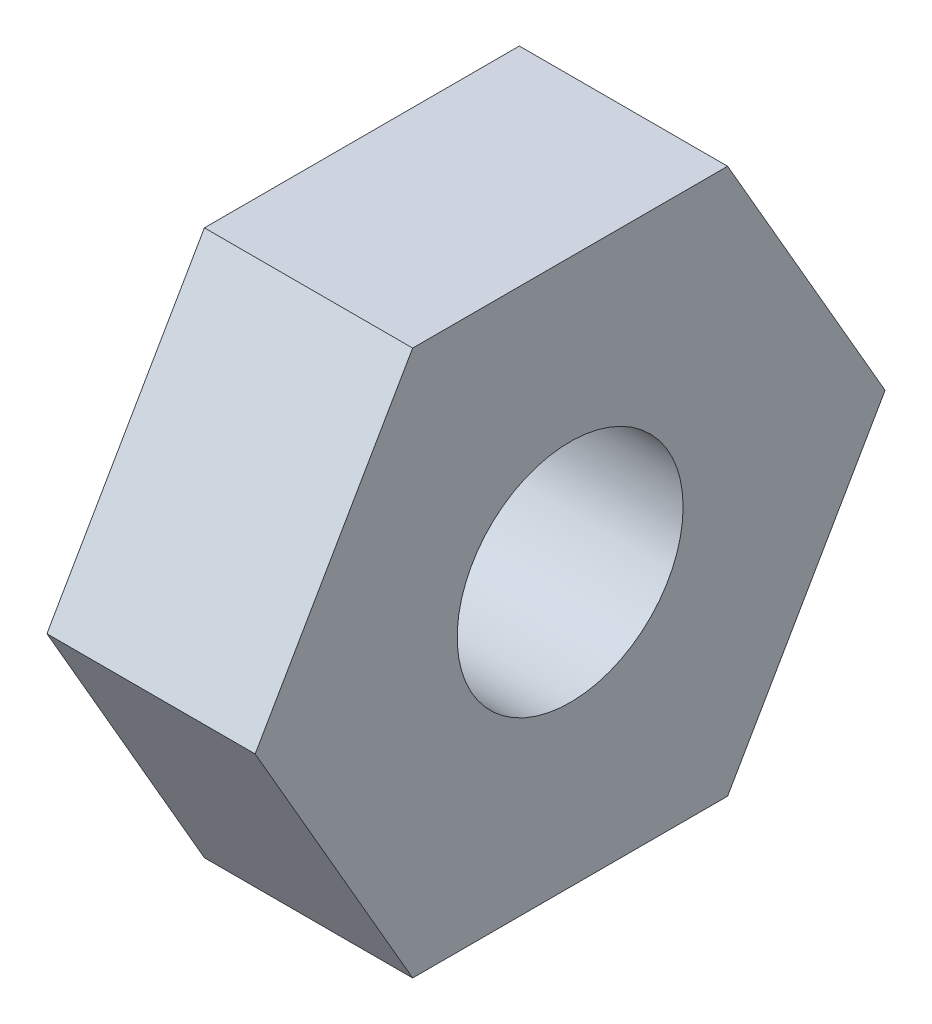
ISO-10303-21;
HEADER;
FILE_DESCRIPTION(('STEP AP214'),'2;1');
FILE_NAME('part.step','',(''),(''),'','','');
FILE_SCHEMA(('AUTOMOTIVE_DESIGN { 1 0 10303 214 1 1 1 1 }'));
ENDSEC;
DATA;
#1=APPLICATION_CONTEXT('core data for automotive mechanical design processes');
#2=APPLICATION_PROTOCOL_DEFINITION('international standard','automotive_design',2000,#1);
#3=PRODUCT_CONTEXT('',#1,'mechanical');
#4=PRODUCT('Part','Part','',(#3));
#5=PRODUCT_RELATED_PRODUCT_CATEGORY('part','',(#4));
#6=PRODUCT_DEFINITION_FORMATION('','',#4);
#7=PRODUCT_DEFINITION_CONTEXT('part definition',#1,'design');
#8=PRODUCT_DEFINITION('design','',#6,#7);
#9=PRODUCT_DEFINITION_SHAPE('','',#8);
#10=(LENGTH_UNIT() NAMED_UNIT(*) SI_UNIT(.MILLI.,.METRE.));
#11=(NAMED_UNIT(*) PLANE_ANGLE_UNIT() SI_UNIT($,.RADIAN.));
#12=(NAMED_UNIT(*) SI_UNIT($,.STERADIAN.) SOLID_ANGLE_UNIT());
#13=UNCERTAINTY_MEASURE_WITH_UNIT(LENGTH_MEASURE(1.E-05),#10,'distance_accuracy_value','');
#14=(GEOMETRIC_REPRESENTATION_CONTEXT(3) GLOBAL_UNCERTAINTY_ASSIGNED_CONTEXT((#13)) GLOBAL_UNIT_ASSIGNED_CONTEXT((#10,
#11,#12)) REPRESENTATION_CONTEXT('',''));
#15=CARTESIAN_POINT('',(0.,0.,0.));
#16=DIRECTION('',(0.,0.,1.));
#17=DIRECTION('',(1.,0.,0.));
#18=AXIS2_PLACEMENT_3D('',#15,#16,#17);
#19=CARTESIAN_POINT('',(4.572,0.,0.));
#20=DIRECTION('',(1.,0.,0.));
#21=DIRECTION('',(0.,0.,-1.));
#22=AXIS2_PLACEMENT_3D('',#19,#20,#21);
#23=PLANE('',#22);
#24=DIRECTION('',(0.,0.,-1.));
#25=VECTOR('',#24,1.);
#26=CARTESIAN_POINT('',(4.572,-5.9875,3.45688473677289));
#27=LINE('',#26,#25);
#28=CARTESIAN_POINT('',(4.572,-5.9875,3.45688473677289));
#29=VERTEX_POINT('',#28);
#30=CARTESIAN_POINT('',(4.572,-5.9875,-3.45688473677288));
#31=VERTEX_POINT('',#30);
#32=EDGE_CURVE('E129',#29,#31,#27,.T.);
#33=ORIENTED_EDGE('',*,*,#32,.T.);
#34=DIRECTION('',(0.,0.866025403784439,-0.5));
#35=VECTOR('',#34,1.);
#36=CARTESIAN_POINT('',(4.572,-5.9875,-3.45688473677288));
#37=LINE('',#36,#35);
#38=CARTESIAN_POINT('',(4.572,0.,-6.91376947354577));
#39=VERTEX_POINT('',#38);
#40=EDGE_CURVE('E87',#31,#39,#37,.T.);
#41=ORIENTED_EDGE('',*,*,#40,.T.);
#42=DIRECTION('',(0.,0.866025403784439,0.5));
#43=VECTOR('',#42,1.);
#44=CARTESIAN_POINT('',(4.572,0.,-6.91376947354577));
#45=LINE('',#44,#43);
#46=CARTESIAN_POINT('',(4.572,5.9875,-3.45688473677288));
#47=VERTEX_POINT('',#46);
#48=EDGE_CURVE('E100',#39,#47,#45,.T.);
#49=ORIENTED_EDGE('',*,*,#48,.T.);
#50=DIRECTION('',(0.,0.,1.));
#51=VECTOR('',#50,1.);
#52=CARTESIAN_POINT('',(4.572,5.9875,-3.45688473677288));
#53=LINE('',#52,#51);
#54=CARTESIAN_POINT('',(4.572,5.9875,3.45688473677289));
#55=VERTEX_POINT('',#54);
#56=EDGE_CURVE('E94',#47,#55,#53,.T.);
#57=ORIENTED_EDGE('',*,*,#56,.T.);
#58=DIRECTION('',(0.,-0.866025403784439,0.5));
#59=VECTOR('',#58,1.);
#60=CARTESIAN_POINT('',(4.572,5.9875,3.45688473677289));
#61=LINE('',#60,#59);
#62=CARTESIAN_POINT('',(4.572,0.,6.91376947354577));
#63=VERTEX_POINT('',#62);
#64=EDGE_CURVE('E98',#55,#63,#61,.T.);
#65=ORIENTED_EDGE('',*,*,#64,.T.);
#66=DIRECTION('',(0.,-0.866025403784439,-0.5));
#67=VECTOR('',#66,1.);
#68=CARTESIAN_POINT('',(4.572,0.,6.91376947354577));
#69=LINE('',#68,#67);
#70=EDGE_CURVE('E50',#63,#29,#69,.T.);
#71=ORIENTED_EDGE('',*,*,#70,.T.);
#72=EDGE_LOOP('',(#33,#41,#49,#57,#65,#71));
#73=FACE_BOUND('',#72,.T.);
#74=CARTESIAN_POINT('',(4.572,0.,0.));
#75=DIRECTION('',(1.,0.,0.));
#76=DIRECTION('',(0.,0.,-1.));
#77=AXIS2_PLACEMENT_3D('',#74,#75,#76);
#78=CIRCLE('',#77,2.48);
#79=CARTESIAN_POINT('',(4.572,0.,-2.48));
#80=VERTEX_POINT('',#79);
#81=EDGE_CURVE('E122',#80,#80,#78,.T.);
#82=ORIENTED_EDGE('',*,*,#81,.F.);
#83=EDGE_LOOP('',(#82));
#84=FACE_BOUND('',#83,.T.);
#85=ADVANCED_FACE('F33',(#73,#84),#23,.T.);
#86=CARTESIAN_POINT('',(0.,0.,0.));
#87=DIRECTION('',(1.,0.,0.));
#88=DIRECTION('',(0.,0.,-1.));
#89=AXIS2_PLACEMENT_3D('',#86,#87,#88);
#90=PLANE('',#89);
#91=CARTESIAN_POINT('',(0.,0.,0.));
#92=DIRECTION('',(1.,0.,0.));
#93=DIRECTION('',(0.,0.,-1.));
#94=AXIS2_PLACEMENT_3D('',#91,#92,#93);
#95=CIRCLE('',#94,3.81);
#96=CARTESIAN_POINT('',(0.,0.,-3.81));
#97=VERTEX_POINT('',#96);
#98=EDGE_CURVE('E177',#97,#97,#95,.T.);
#99=ORIENTED_EDGE('',*,*,#98,.T.);
#100=EDGE_LOOP('',(#99));
#101=FACE_BOUND('',#100,.T.);
#102=DIRECTION('',(0.,0.,-1.));
#103=VECTOR('',#102,1.);
#104=CARTESIAN_POINT('',(0.,-5.9875,3.45688473677289));
#105=LINE('',#104,#103);
#106=CARTESIAN_POINT('',(0.,-5.9875,3.45688473677289));
#107=VERTEX_POINT('',#106);
#108=CARTESIAN_POINT('',(0.,-5.9875,-3.45688473677288));
#109=VERTEX_POINT('',#108);
#110=EDGE_CURVE('E118',#107,#109,#105,.T.);
#111=ORIENTED_EDGE('',*,*,#110,.F.);
#112=DIRECTION('',(0.,-0.866025403784439,-0.5));
#113=VECTOR('',#112,1.);
#114=CARTESIAN_POINT('',(0.,0.,6.91376947354577));
#115=LINE('',#114,#113);
#116=CARTESIAN_POINT('',(0.,0.,6.91376947354577));
#117=VERTEX_POINT('',#116);
#118=EDGE_CURVE('E79',#117,#107,#115,.T.);
#119=ORIENTED_EDGE('',*,*,#118,.F.);
#120=DIRECTION('',(0.,-0.866025403784439,0.5));
#121=VECTOR('',#120,1.);
#122=CARTESIAN_POINT('',(0.,5.9875,3.45688473677289));
#123=LINE('',#122,#121);
#124=CARTESIAN_POINT('',(0.,5.9875,3.45688473677289));
#125=VERTEX_POINT('',#124);
#126=EDGE_CURVE('E73',#125,#117,#123,.T.);
#127=ORIENTED_EDGE('',*,*,#126,.F.);
#128=DIRECTION('',(0.,0.,1.));
#129=VECTOR('',#128,1.);
#130=CARTESIAN_POINT('',(0.,5.9875,-3.45688473677288));
#131=LINE('',#130,#129);
#132=CARTESIAN_POINT('',(0.,5.9875,-3.45688473677288));
#133=VERTEX_POINT('',#132);
#134=EDGE_CURVE('E108',#133,#125,#131,.T.);
#135=ORIENTED_EDGE('',*,*,#134,.F.);
#136=DIRECTION('',(0.,0.866025403784439,0.5));
#137=VECTOR('',#136,1.);
#138=CARTESIAN_POINT('',(0.,0.,-6.91376947354577));
#139=LINE('',#138,#137);
#140=CARTESIAN_POINT('',(0.,0.,-6.91376947354577));
#141=VERTEX_POINT('',#140);
#142=EDGE_CURVE('E124',#141,#133,#139,.T.);
#143=ORIENTED_EDGE('',*,*,#142,.F.);
#144=DIRECTION('',(0.,0.866025403784439,-0.5));
#145=VECTOR('',#144,1.);
#146=CARTESIAN_POINT('',(0.,-5.9875,-3.45688473677288));
#147=LINE('',#146,#145);
#148=EDGE_CURVE('E121',#109,#141,#147,.T.);
#149=ORIENTED_EDGE('',*,*,#148,.F.);
#150=EDGE_LOOP('',(#111,#119,#127,#135,#143,#149));
#151=FACE_BOUND('',#150,.T.);
#152=ADVANCED_FACE('F138',(#101,#151),#90,.F.);
#153=CARTESIAN_POINT('',(4.572,-5.9875,3.45688473677289));
#154=DIRECTION('',(0.,1.,0.));
#155=DIRECTION('',(0.,0.,1.));
#156=AXIS2_PLACEMENT_3D('',#153,#154,#155);
#157=PLANE('',#156);
#158=ORIENTED_EDGE('',*,*,#110,.T.);
#159=DIRECTION('',(-1.,0.,0.));
#160=VECTOR('',#159,1.);
#161=CARTESIAN_POINT('',(4.572,-5.9875,-3.45688473677288));
#162=LINE('',#161,#160);
#163=EDGE_CURVE('E11',#31,#109,#162,.T.);
#164=ORIENTED_EDGE('',*,*,#163,.F.);
#165=ORIENTED_EDGE('',*,*,#32,.F.);
#166=DIRECTION('',(-1.,0.,0.));
#167=VECTOR('',#166,1.);
#168=CARTESIAN_POINT('',(4.572,-5.9875,3.45688473677289));
#169=LINE('',#168,#167);
#170=EDGE_CURVE('E114',#29,#107,#169,.T.);
#171=ORIENTED_EDGE('',*,*,#170,.T.);
#172=EDGE_LOOP('',(#158,#164,#165,#171));
#173=FACE_BOUND('',#172,.T.);
#174=ADVANCED_FACE('F35',(#173),#157,.F.);
#175=CARTESIAN_POINT('',(4.572,-5.9875,-3.45688473677288));
#176=DIRECTION('',(0.,0.5,0.866025403784439));
#177=DIRECTION('',(0.,-0.866025403784439,0.5));
#178=AXIS2_PLACEMENT_3D('',#175,#176,#177);
#179=PLANE('',#178);
#180=ORIENTED_EDGE('',*,*,#148,.T.);
#181=DIRECTION('',(-1.,0.,0.));
#182=VECTOR('',#181,1.);
#183=CARTESIAN_POINT('',(4.572,0.,-6.91376947354577));
#184=LINE('',#183,#182);
#185=EDGE_CURVE('E42',#39,#141,#184,.T.);
#186=ORIENTED_EDGE('',*,*,#185,.F.);
#187=ORIENTED_EDGE('',*,*,#40,.F.);
#188=ORIENTED_EDGE('',*,*,#163,.T.);
#189=EDGE_LOOP('',(#180,#186,#187,#188));
#190=FACE_BOUND('',#189,.T.);
#191=ADVANCED_FACE('F235',(#190),#179,.F.);
#192=CARTESIAN_POINT('',(4.572,0.,-6.91376947354577));
#193=DIRECTION('',(0.,-0.5,0.866025403784439));
#194=DIRECTION('',(0.,-0.866025403784439,-0.5));
#195=AXIS2_PLACEMENT_3D('',#192,#193,#194);
#196=PLANE('',#195);
#197=ORIENTED_EDGE('',*,*,#142,.T.);
#198=DIRECTION('',(-1.,0.,0.));
#199=VECTOR('',#198,1.);
#200=CARTESIAN_POINT('',(4.572,5.9875,-3.45688473677288));
#201=LINE('',#200,#199);
#202=EDGE_CURVE('E109',#47,#133,#201,.T.);
#203=ORIENTED_EDGE('',*,*,#202,.F.);
#204=ORIENTED_EDGE('',*,*,#48,.F.);
#205=ORIENTED_EDGE('',*,*,#185,.T.);
#206=EDGE_LOOP('',(#197,#203,#204,#205));
#207=FACE_BOUND('',#206,.T.);
#208=ADVANCED_FACE('F135',(#207),#196,.F.);
#209=CARTESIAN_POINT('',(4.572,5.9875,-3.45688473677288));
#210=DIRECTION('',(0.,-1.,0.));
#211=DIRECTION('',(0.,0.,-1.));
#212=AXIS2_PLACEMENT_3D('',#209,#210,#211);
#213=PLANE('',#212);
#214=ORIENTED_EDGE('',*,*,#134,.T.);
#215=DIRECTION('',(-1.,0.,0.));
#216=VECTOR('',#215,1.);
#217=CARTESIAN_POINT('',(4.572,5.9875,3.45688473677289));
#218=LINE('',#217,#216);
#219=EDGE_CURVE('E105',#55,#125,#218,.T.);
#220=ORIENTED_EDGE('',*,*,#219,.F.);
#221=ORIENTED_EDGE('',*,*,#56,.F.);
#222=ORIENTED_EDGE('',*,*,#202,.T.);
#223=EDGE_LOOP('',(#214,#220,#221,#222));
#224=FACE_BOUND('',#223,.T.);
#225=ADVANCED_FACE('F106',(#224),#213,.F.);
#226=CARTESIAN_POINT('',(4.572,5.9875,3.45688473677289));
#227=DIRECTION('',(0.,-0.5,-0.866025403784439));
#228=DIRECTION('',(0.,0.866025403784439,-0.5));
#229=AXIS2_PLACEMENT_3D('',#226,#227,#228);
#230=PLANE('',#229);
#231=ORIENTED_EDGE('',*,*,#126,.T.);
#232=DIRECTION('',(-1.,0.,0.));
#233=VECTOR('',#232,1.);
#234=CARTESIAN_POINT('',(4.572,0.,6.91376947354577));
#235=LINE('',#234,#233);
#236=EDGE_CURVE('E110',#63,#117,#235,.T.);
#237=ORIENTED_EDGE('',*,*,#236,.F.);
#238=ORIENTED_EDGE('',*,*,#64,.F.);
#239=ORIENTED_EDGE('',*,*,#219,.T.);
#240=EDGE_LOOP('',(#231,#237,#238,#239));
#241=FACE_BOUND('',#240,.T.);
#242=ADVANCED_FACE('F112',(#241),#230,.F.);
#243=CARTESIAN_POINT('',(4.572,0.,6.91376947354577));
#244=DIRECTION('',(0.,0.5,-0.866025403784439));
#245=DIRECTION('',(0.,0.866025403784439,0.5));
#246=AXIS2_PLACEMENT_3D('',#243,#244,#245);
#247=PLANE('',#246);
#248=ORIENTED_EDGE('',*,*,#118,.T.);
#249=ORIENTED_EDGE('',*,*,#170,.F.);
#250=ORIENTED_EDGE('',*,*,#70,.F.);
#251=ORIENTED_EDGE('',*,*,#236,.T.);
#252=EDGE_LOOP('',(#248,#249,#250,#251));
#253=FACE_BOUND('',#252,.T.);
#254=ADVANCED_FACE('F142',(#253),#247,.F.);
#255=CARTESIAN_POINT('',(4.572,0.,0.));
#256=DIRECTION('',(-1.,0.,0.));
#257=DIRECTION('',(0.,0.,1.));
#258=AXIS2_PLACEMENT_3D('',#255,#256,#257);
#259=CYLINDRICAL_SURFACE('',#258,2.48);
#260=ORIENTED_EDGE('',*,*,#81,.T.);
#261=EDGE_LOOP('',(#260));
#262=FACE_BOUND('',#261,.T.);
#263=CARTESIAN_POINT('',(-1.016,0.,0.));
#264=DIRECTION('',(1.,0.,0.));
#265=DIRECTION('',(0.,0.,-1.));
#266=AXIS2_PLACEMENT_3D('',#263,#264,#265);
#267=CIRCLE('',#266,2.48);
#268=CARTESIAN_POINT('',(-1.016,0.,-2.48));
#269=VERTEX_POINT('',#268);
#270=EDGE_CURVE('E173',#269,#269,#267,.T.);
#271=ORIENTED_EDGE('',*,*,#270,.F.);
#272=EDGE_LOOP('',(#271));
#273=FACE_BOUND('',#272,.T.);
#274=ADVANCED_FACE('F144',(#262,#273),#259,.F.);
#275=CARTESIAN_POINT('',(-1.016,0.,0.));
#276=DIRECTION('',(1.,0.,0.));
#277=DIRECTION('',(0.,0.,-1.));
#278=AXIS2_PLACEMENT_3D('',#275,#276,#277);
#279=CYLINDRICAL_SURFACE('',#278,3.81);
#280=CARTESIAN_POINT('',(-1.016,0.,0.));
#281=DIRECTION('',(1.,0.,0.));
#282=DIRECTION('',(0.,0.,-1.));
#283=AXIS2_PLACEMENT_3D('',#280,#281,#282);
#284=CIRCLE('',#283,3.81);
#285=CARTESIAN_POINT('',(-1.016,0.,-3.81));
#286=VERTEX_POINT('',#285);
#287=EDGE_CURVE('E176',#286,#286,#284,.T.);
#288=ORIENTED_EDGE('',*,*,#287,.T.);
#289=EDGE_LOOP('',(#288));
#290=FACE_BOUND('',#289,.T.);
#291=ORIENTED_EDGE('',*,*,#98,.F.);
#292=EDGE_LOOP('',(#291));
#293=FACE_BOUND('',#292,.T.);
#294=ADVANCED_FACE('F150',(#290,#293),#279,.T.);
#295=CARTESIAN_POINT('',(-1.016,0.,0.));
#296=DIRECTION('',(1.,0.,0.));
#297=DIRECTION('',(0.,0.,-1.));
#298=AXIS2_PLACEMENT_3D('',#295,#296,#297);
#299=PLANE('',#298);
#300=ORIENTED_EDGE('',*,*,#270,.T.);
#301=EDGE_LOOP('',(#300));
#302=FACE_BOUND('',#301,.T.);
#303=ORIENTED_EDGE('',*,*,#287,.F.);
#304=EDGE_LOOP('',(#303));
#305=FACE_BOUND('',#304,.T.);
#306=ADVANCED_FACE('F164',(#302,#305),#299,.F.);
#307=CLOSED_SHELL('',(#85,#152,#174,#191,#208,#225,#242,#254,#274,#294,#306));
#308=MANIFOLD_SOLID_BREP('B2',#307);
#309=ADVANCED_BREP_SHAPE_REPRESENTATION('',(#18,#308),#14);
#310=SHAPE_DEFINITION_REPRESENTATION(#9,#309);
ENDSEC;
END-ISO-10303-21;
